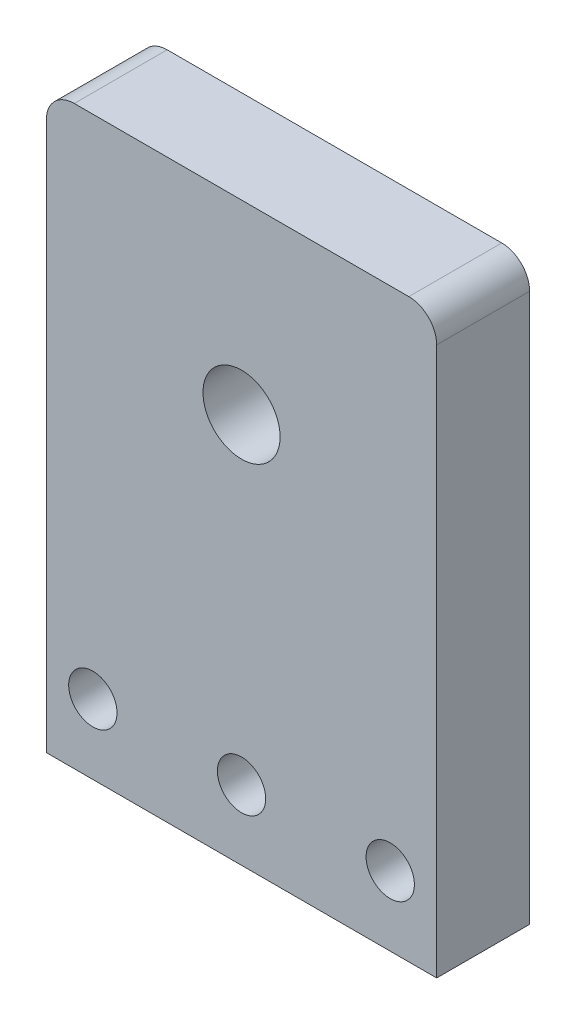
ISO-10303-21;
HEADER;
FILE_DESCRIPTION(('STEP AP214'),'2;1');
FILE_NAME('part.step','',(''),(''),'','','');
FILE_SCHEMA(('AUTOMOTIVE_DESIGN { 1 0 10303 214 1 1 1 1 }'));
ENDSEC;
DATA;
#1=APPLICATION_CONTEXT('core data for automotive mechanical design processes');
#2=APPLICATION_PROTOCOL_DEFINITION('international standard','automotive_design',2000,#1);
#3=PRODUCT_CONTEXT('',#1,'mechanical');
#4=PRODUCT('Part','Part','',(#3));
#5=PRODUCT_RELATED_PRODUCT_CATEGORY('part','',(#4));
#6=PRODUCT_DEFINITION_FORMATION('','',#4);
#7=PRODUCT_DEFINITION_CONTEXT('part definition',#1,'design');
#8=PRODUCT_DEFINITION('design','',#6,#7);
#9=PRODUCT_DEFINITION_SHAPE('','',#8);
#10=(LENGTH_UNIT() NAMED_UNIT(*) SI_UNIT(.MILLI.,.METRE.));
#11=(NAMED_UNIT(*) PLANE_ANGLE_UNIT() SI_UNIT($,.RADIAN.));
#12=(NAMED_UNIT(*) SI_UNIT($,.STERADIAN.) SOLID_ANGLE_UNIT());
#13=UNCERTAINTY_MEASURE_WITH_UNIT(LENGTH_MEASURE(1.E-05),#10,'distance_accuracy_value','');
#14=(GEOMETRIC_REPRESENTATION_CONTEXT(3) GLOBAL_UNCERTAINTY_ASSIGNED_CONTEXT((#13)) GLOBAL_UNIT_ASSIGNED_CONTEXT((#10,
#11,#12)) REPRESENTATION_CONTEXT('',''));
#15=CARTESIAN_POINT('',(0.,0.,0.));
#16=DIRECTION('',(0.,0.,1.));
#17=DIRECTION('',(1.,0.,0.));
#18=AXIS2_PLACEMENT_3D('',#15,#16,#17);
#19=CARTESIAN_POINT('',(0.,0.,10.));
#20=DIRECTION('',(0.,0.,-1.));
#21=DIRECTION('',(-1.,0.,0.));
#22=AXIS2_PLACEMENT_3D('',#19,#20,#21);
#23=PLANE('',#22);
#24=CARTESIAN_POINT('',(4.99999999999999,7.5,10.));
#25=DIRECTION('',(0.,0.,1.));
#26=DIRECTION('',(1.,0.,0.));
#27=AXIS2_PLACEMENT_3D('',#24,#25,#26);
#28=CIRCLE('',#27,2.6);
#29=CARTESIAN_POINT('',(7.59999999999999,7.5,10.));
#30=VERTEX_POINT('',#29);
#31=EDGE_CURVE('E199',#30,#30,#28,.T.);
#32=ORIENTED_EDGE('',*,*,#31,.F.);
#33=EDGE_LOOP('',(#32));
#34=FACE_BOUND('',#33,.T.);
#35=CARTESIAN_POINT('',(21.,7.5,10.));
#36=DIRECTION('',(0.,0.,1.));
#37=DIRECTION('',(1.,0.,0.));
#38=AXIS2_PLACEMENT_3D('',#35,#36,#37);
#39=CIRCLE('',#38,2.6);
#40=CARTESIAN_POINT('',(23.6,7.5,10.));
#41=VERTEX_POINT('',#40);
#42=EDGE_CURVE('E195',#41,#41,#39,.T.);
#43=ORIENTED_EDGE('',*,*,#42,.F.);
#44=EDGE_LOOP('',(#43));
#45=FACE_BOUND('',#44,.T.);
#46=CARTESIAN_POINT('',(37.,7.5,10.));
#47=DIRECTION('',(0.,0.,1.));
#48=DIRECTION('',(1.,0.,0.));
#49=AXIS2_PLACEMENT_3D('',#46,#47,#48);
#50=CIRCLE('',#49,2.6);
#51=CARTESIAN_POINT('',(39.6,7.5,10.));
#52=VERTEX_POINT('',#51);
#53=EDGE_CURVE('E187',#52,#52,#50,.T.);
#54=ORIENTED_EDGE('',*,*,#53,.F.);
#55=EDGE_LOOP('',(#54));
#56=FACE_BOUND('',#55,.T.);
#57=DIRECTION('',(0.,1.,0.));
#58=VECTOR('',#57,1.);
#59=CARTESIAN_POINT('',(42.,0.,10.));
#60=LINE('',#59,#58);
#61=CARTESIAN_POINT('',(42.,0.,10.));
#62=VERTEX_POINT('',#61);
#63=CARTESIAN_POINT('',(42.,59.,10.));
#64=VERTEX_POINT('',#63);
#65=EDGE_CURVE('E115',#62,#64,#60,.T.);
#66=ORIENTED_EDGE('',*,*,#65,.T.);
#67=CARTESIAN_POINT('',(39.,59.,10.));
#68=DIRECTION('',(0.,0.,-1.));
#69=DIRECTION('',(-1.,0.,0.));
#70=AXIS2_PLACEMENT_3D('',#67,#68,#69);
#71=CIRCLE('',#70,3.);
#72=CARTESIAN_POINT('',(39.,62.,10.));
#73=VERTEX_POINT('',#72);
#74=EDGE_CURVE('E52',#64,#73,#71,.F.);
#75=ORIENTED_EDGE('',*,*,#74,.T.);
#76=DIRECTION('',(-1.,0.,0.));
#77=VECTOR('',#76,1.);
#78=CARTESIAN_POINT('',(0.,62.,10.));
#79=LINE('',#78,#77);
#80=CARTESIAN_POINT('',(2.99999999999999,62.,10.));
#81=VERTEX_POINT('',#80);
#82=EDGE_CURVE('E128',#73,#81,#79,.T.);
#83=ORIENTED_EDGE('',*,*,#82,.T.);
#84=CARTESIAN_POINT('',(2.99999999999999,59.,10.));
#85=DIRECTION('',(0.,0.,-1.));
#86=DIRECTION('',(-1.,0.,0.));
#87=AXIS2_PLACEMENT_3D('',#84,#85,#86);
#88=CIRCLE('',#87,3.);
#89=CARTESIAN_POINT('',(0.,59.,10.));
#90=VERTEX_POINT('',#89);
#91=EDGE_CURVE('E59',#81,#90,#88,.F.);
#92=ORIENTED_EDGE('',*,*,#91,.T.);
#93=DIRECTION('',(0.,-1.,0.));
#94=VECTOR('',#93,1.);
#95=CARTESIAN_POINT('',(0.,0.,10.));
#96=LINE('',#95,#94);
#97=CARTESIAN_POINT('',(0.,0.,10.));
#98=VERTEX_POINT('',#97);
#99=EDGE_CURVE('E97',#90,#98,#96,.T.);
#100=ORIENTED_EDGE('',*,*,#99,.T.);
#101=DIRECTION('',(1.,0.,0.));
#102=VECTOR('',#101,1.);
#103=CARTESIAN_POINT('',(0.,0.,10.));
#104=LINE('',#103,#102);
#105=EDGE_CURVE('E100',#98,#62,#104,.T.);
#106=ORIENTED_EDGE('',*,*,#105,.T.);
#107=EDGE_LOOP('',(#66,#75,#83,#92,#100,#106));
#108=FACE_BOUND('',#107,.T.);
#109=CARTESIAN_POINT('',(21.,42.,10.));
#110=DIRECTION('',(0.,0.,1.));
#111=DIRECTION('',(1.,0.,0.));
#112=AXIS2_PLACEMENT_3D('',#109,#110,#111);
#113=CIRCLE('',#112,4.15);
#114=CARTESIAN_POINT('',(25.15,42.,10.));
#115=VERTEX_POINT('',#114);
#116=EDGE_CURVE('E171',#115,#115,#113,.T.);
#117=ORIENTED_EDGE('',*,*,#116,.F.);
#118=EDGE_LOOP('',(#117));
#119=FACE_BOUND('',#118,.T.);
#120=ADVANCED_FACE('F43',(#34,#45,#56,#108,#119),#23,.F.);
#121=CARTESIAN_POINT('',(0.,0.,0.));
#122=DIRECTION('',(0.,0.,-1.));
#123=DIRECTION('',(-1.,0.,0.));
#124=AXIS2_PLACEMENT_3D('',#121,#122,#123);
#125=PLANE('',#124);
#126=CARTESIAN_POINT('',(4.99999999999999,7.5,0.));
#127=DIRECTION('',(0.,0.,1.));
#128=DIRECTION('',(1.,0.,0.));
#129=AXIS2_PLACEMENT_3D('',#126,#127,#128);
#130=CIRCLE('',#129,2.6);
#131=CARTESIAN_POINT('',(7.59999999999999,7.5,0.));
#132=VERTEX_POINT('',#131);
#133=EDGE_CURVE('E179',#132,#132,#130,.T.);
#134=ORIENTED_EDGE('',*,*,#133,.T.);
#135=EDGE_LOOP('',(#134));
#136=FACE_BOUND('',#135,.T.);
#137=CARTESIAN_POINT('',(21.,7.5,0.));
#138=DIRECTION('',(0.,0.,1.));
#139=DIRECTION('',(1.,0.,0.));
#140=AXIS2_PLACEMENT_3D('',#137,#138,#139);
#141=CIRCLE('',#140,2.6);
#142=CARTESIAN_POINT('',(23.6,7.5,0.));
#143=VERTEX_POINT('',#142);
#144=EDGE_CURVE('E191',#143,#143,#141,.T.);
#145=ORIENTED_EDGE('',*,*,#144,.T.);
#146=EDGE_LOOP('',(#145));
#147=FACE_BOUND('',#146,.T.);
#148=CARTESIAN_POINT('',(37.,7.5,0.));
#149=DIRECTION('',(0.,0.,1.));
#150=DIRECTION('',(1.,0.,0.));
#151=AXIS2_PLACEMENT_3D('',#148,#149,#150);
#152=CIRCLE('',#151,2.6);
#153=CARTESIAN_POINT('',(39.6,7.5,0.));
#154=VERTEX_POINT('',#153);
#155=EDGE_CURVE('E183',#154,#154,#152,.T.);
#156=ORIENTED_EDGE('',*,*,#155,.T.);
#157=EDGE_LOOP('',(#156));
#158=FACE_BOUND('',#157,.T.);
#159=DIRECTION('',(-1.,0.,0.));
#160=VECTOR('',#159,1.);
#161=CARTESIAN_POINT('',(0.,62.,0.));
#162=LINE('',#161,#160);
#163=CARTESIAN_POINT('',(39.,62.,0.));
#164=VERTEX_POINT('',#163);
#165=CARTESIAN_POINT('',(2.99999999999999,62.,0.));
#166=VERTEX_POINT('',#165);
#167=EDGE_CURVE('E106',#164,#166,#162,.T.);
#168=ORIENTED_EDGE('',*,*,#167,.F.);
#169=CARTESIAN_POINT('',(39.,59.,0.));
#170=DIRECTION('',(0.,0.,-1.));
#171=DIRECTION('',(-1.,0.,0.));
#172=AXIS2_PLACEMENT_3D('',#169,#170,#171);
#173=CIRCLE('',#172,3.);
#174=CARTESIAN_POINT('',(42.,59.,0.));
#175=VERTEX_POINT('',#174);
#176=EDGE_CURVE('E138',#164,#175,#173,.T.);
#177=ORIENTED_EDGE('',*,*,#176,.T.);
#178=DIRECTION('',(0.,1.,0.));
#179=VECTOR('',#178,1.);
#180=CARTESIAN_POINT('',(42.,0.,0.));
#181=LINE('',#180,#179);
#182=CARTESIAN_POINT('',(42.,0.,0.));
#183=VERTEX_POINT('',#182);
#184=EDGE_CURVE('E161',#183,#175,#181,.T.);
#185=ORIENTED_EDGE('',*,*,#184,.F.);
#186=DIRECTION('',(1.,0.,0.));
#187=VECTOR('',#186,1.);
#188=CARTESIAN_POINT('',(0.,0.,0.));
#189=LINE('',#188,#187);
#190=CARTESIAN_POINT('',(0.,0.,0.));
#191=VERTEX_POINT('',#190);
#192=EDGE_CURVE('E164',#191,#183,#189,.T.);
#193=ORIENTED_EDGE('',*,*,#192,.F.);
#194=DIRECTION('',(0.,-1.,0.));
#195=VECTOR('',#194,1.);
#196=CARTESIAN_POINT('',(0.,0.,0.));
#197=LINE('',#196,#195);
#198=CARTESIAN_POINT('',(0.,59.,0.));
#199=VERTEX_POINT('',#198);
#200=EDGE_CURVE('E119',#199,#191,#197,.T.);
#201=ORIENTED_EDGE('',*,*,#200,.F.);
#202=CARTESIAN_POINT('',(2.99999999999999,59.,0.));
#203=DIRECTION('',(0.,0.,-1.));
#204=DIRECTION('',(-1.,0.,0.));
#205=AXIS2_PLACEMENT_3D('',#202,#203,#204);
#206=CIRCLE('',#205,3.);
#207=EDGE_CURVE('E135',#199,#166,#206,.T.);
#208=ORIENTED_EDGE('',*,*,#207,.T.);
#209=EDGE_LOOP('',(#168,#177,#185,#193,#201,#208));
#210=FACE_BOUND('',#209,.T.);
#211=CARTESIAN_POINT('',(21.,42.,0.));
#212=DIRECTION('',(0.,0.,1.));
#213=DIRECTION('',(1.,0.,0.));
#214=AXIS2_PLACEMENT_3D('',#211,#212,#213);
#215=CIRCLE('',#214,4.15);
#216=CARTESIAN_POINT('',(25.15,42.,0.));
#217=VERTEX_POINT('',#216);
#218=EDGE_CURVE('E175',#217,#217,#215,.T.);
#219=ORIENTED_EDGE('',*,*,#218,.T.);
#220=EDGE_LOOP('',(#219));
#221=FACE_BOUND('',#220,.T.);
#222=ADVANCED_FACE('F159',(#136,#147,#158,#210,#221),#125,.T.);
#223=CARTESIAN_POINT('',(0.,0.,10.));
#224=DIRECTION('',(1.,0.,0.));
#225=DIRECTION('',(0.,1.,0.));
#226=AXIS2_PLACEMENT_3D('',#223,#224,#225);
#227=PLANE('',#226);
#228=ORIENTED_EDGE('',*,*,#99,.F.);
#229=DIRECTION('',(0.,0.,-1.));
#230=VECTOR('',#229,1.);
#231=CARTESIAN_POINT('',(0.,59.,10.));
#232=LINE('',#231,#230);
#233=EDGE_CURVE('E11',#90,#199,#232,.T.);
#234=ORIENTED_EDGE('',*,*,#233,.T.);
#235=ORIENTED_EDGE('',*,*,#200,.T.);
#236=DIRECTION('',(0.,0.,-1.));
#237=VECTOR('',#236,1.);
#238=CARTESIAN_POINT('',(0.,0.,10.));
#239=LINE('',#238,#237);
#240=EDGE_CURVE('E111',#98,#191,#239,.T.);
#241=ORIENTED_EDGE('',*,*,#240,.F.);
#242=EDGE_LOOP('',(#228,#234,#235,#241));
#243=FACE_BOUND('',#242,.T.);
#244=ADVANCED_FACE('F117',(#243),#227,.F.);
#245=CARTESIAN_POINT('',(0.,0.,10.));
#246=DIRECTION('',(0.,1.,0.));
#247=DIRECTION('',(0.,0.,1.));
#248=AXIS2_PLACEMENT_3D('',#245,#246,#247);
#249=PLANE('',#248);
#250=ORIENTED_EDGE('',*,*,#192,.T.);
#251=DIRECTION('',(0.,0.,-1.));
#252=VECTOR('',#251,1.);
#253=CARTESIAN_POINT('',(42.,0.,10.));
#254=LINE('',#253,#252);
#255=EDGE_CURVE('E113',#62,#183,#254,.T.);
#256=ORIENTED_EDGE('',*,*,#255,.F.);
#257=ORIENTED_EDGE('',*,*,#105,.F.);
#258=ORIENTED_EDGE('',*,*,#240,.T.);
#259=EDGE_LOOP('',(#250,#256,#257,#258));
#260=FACE_BOUND('',#259,.T.);
#261=ADVANCED_FACE('F110',(#260),#249,.F.);
#262=CARTESIAN_POINT('',(42.,0.,10.));
#263=DIRECTION('',(-1.,0.,0.));
#264=DIRECTION('',(0.,-1.,0.));
#265=AXIS2_PLACEMENT_3D('',#262,#263,#264);
#266=PLANE('',#265);
#267=ORIENTED_EDGE('',*,*,#184,.T.);
#268=DIRECTION('',(0.,0.,-1.));
#269=VECTOR('',#268,1.);
#270=CARTESIAN_POINT('',(42.,59.,10.));
#271=LINE('',#270,#269);
#272=EDGE_CURVE('E67',#175,#64,#271,.F.);
#273=ORIENTED_EDGE('',*,*,#272,.T.);
#274=ORIENTED_EDGE('',*,*,#65,.F.);
#275=ORIENTED_EDGE('',*,*,#255,.T.);
#276=EDGE_LOOP('',(#267,#273,#274,#275));
#277=FACE_BOUND('',#276,.T.);
#278=ADVANCED_FACE('F162',(#277),#266,.F.);
#279=CARTESIAN_POINT('',(0.,62.,10.));
#280=DIRECTION('',(0.,-1.,0.));
#281=DIRECTION('',(0.,0.,-1.));
#282=AXIS2_PLACEMENT_3D('',#279,#280,#281);
#283=PLANE('',#282);
#284=ORIENTED_EDGE('',*,*,#82,.F.);
#285=DIRECTION('',(0.,0.,-1.));
#286=VECTOR('',#285,1.);
#287=CARTESIAN_POINT('',(39.,62.,10.));
#288=LINE('',#287,#286);
#289=EDGE_CURVE('E126',#73,#164,#288,.T.);
#290=ORIENTED_EDGE('',*,*,#289,.T.);
#291=ORIENTED_EDGE('',*,*,#167,.T.);
#292=DIRECTION('',(0.,0.,-1.));
#293=VECTOR('',#292,1.);
#294=CARTESIAN_POINT('',(2.99999999999999,62.,10.));
#295=LINE('',#294,#293);
#296=EDGE_CURVE('E122',#166,#81,#295,.F.);
#297=ORIENTED_EDGE('',*,*,#296,.T.);
#298=EDGE_LOOP('',(#284,#290,#291,#297));
#299=FACE_BOUND('',#298,.T.);
#300=ADVANCED_FACE('F150',(#299),#283,.F.);
#301=CARTESIAN_POINT('',(21.,42.,10.));
#302=DIRECTION('',(0.,0.,-1.));
#303=DIRECTION('',(-1.,0.,0.));
#304=AXIS2_PLACEMENT_3D('',#301,#302,#303);
#305=CYLINDRICAL_SURFACE('',#304,4.15);
#306=ORIENTED_EDGE('',*,*,#116,.T.);
#307=EDGE_LOOP('',(#306));
#308=FACE_BOUND('',#307,.T.);
#309=ORIENTED_EDGE('',*,*,#218,.F.);
#310=EDGE_LOOP('',(#309));
#311=FACE_BOUND('',#310,.T.);
#312=ADVANCED_FACE('F236',(#308,#311),#305,.F.);
#313=CARTESIAN_POINT('',(39.,59.,10.));
#314=DIRECTION('',(0.,0.,-1.));
#315=DIRECTION('',(-1.,0.,0.));
#316=AXIS2_PLACEMENT_3D('',#313,#314,#315);
#317=CYLINDRICAL_SURFACE('',#316,3.);
#318=ORIENTED_EDGE('',*,*,#74,.F.);
#319=ORIENTED_EDGE('',*,*,#272,.F.);
#320=ORIENTED_EDGE('',*,*,#176,.F.);
#321=ORIENTED_EDGE('',*,*,#289,.F.);
#322=EDGE_LOOP('',(#318,#319,#320,#321));
#323=FACE_BOUND('',#322,.T.);
#324=ADVANCED_FACE('F156',(#323),#317,.T.);
#325=CARTESIAN_POINT('',(2.99999999999999,59.,10.));
#326=DIRECTION('',(0.,0.,-1.));
#327=DIRECTION('',(-1.,0.,0.));
#328=AXIS2_PLACEMENT_3D('',#325,#326,#327);
#329=CYLINDRICAL_SURFACE('',#328,3.);
#330=ORIENTED_EDGE('',*,*,#91,.F.);
#331=ORIENTED_EDGE('',*,*,#296,.F.);
#332=ORIENTED_EDGE('',*,*,#207,.F.);
#333=ORIENTED_EDGE('',*,*,#233,.F.);
#334=EDGE_LOOP('',(#330,#331,#332,#333));
#335=FACE_BOUND('',#334,.T.);
#336=ADVANCED_FACE('F45',(#335),#329,.T.);
#337=CARTESIAN_POINT('',(37.,7.5,0.));
#338=DIRECTION('',(0.,0.,1.));
#339=DIRECTION('',(1.,0.,0.));
#340=AXIS2_PLACEMENT_3D('',#337,#338,#339);
#341=CYLINDRICAL_SURFACE('',#340,2.6);
#342=ORIENTED_EDGE('',*,*,#155,.F.);
#343=EDGE_LOOP('',(#342));
#344=FACE_BOUND('',#343,.T.);
#345=ORIENTED_EDGE('',*,*,#53,.T.);
#346=EDGE_LOOP('',(#345));
#347=FACE_BOUND('',#346,.T.);
#348=ADVANCED_FACE('F223',(#344,#347),#341,.F.);
#349=CARTESIAN_POINT('',(21.,7.5,0.));
#350=DIRECTION('',(0.,0.,1.));
#351=DIRECTION('',(1.,0.,0.));
#352=AXIS2_PLACEMENT_3D('',#349,#350,#351);
#353=CYLINDRICAL_SURFACE('',#352,2.6);
#354=ORIENTED_EDGE('',*,*,#144,.F.);
#355=EDGE_LOOP('',(#354));
#356=FACE_BOUND('',#355,.T.);
#357=ORIENTED_EDGE('',*,*,#42,.T.);
#358=EDGE_LOOP('',(#357));
#359=FACE_BOUND('',#358,.T.);
#360=ADVANCED_FACE('F212',(#356,#359),#353,.F.);
#361=CARTESIAN_POINT('',(4.99999999999999,7.5,0.));
#362=DIRECTION('',(0.,0.,1.));
#363=DIRECTION('',(1.,0.,0.));
#364=AXIS2_PLACEMENT_3D('',#361,#362,#363);
#365=CYLINDRICAL_SURFACE('',#364,2.6);
#366=ORIENTED_EDGE('',*,*,#133,.F.);
#367=EDGE_LOOP('',(#366));
#368=FACE_BOUND('',#367,.T.);
#369=ORIENTED_EDGE('',*,*,#31,.T.);
#370=EDGE_LOOP('',(#369));
#371=FACE_BOUND('',#370,.T.);
#372=ADVANCED_FACE('F209',(#368,#371),#365,.F.);
#373=CLOSED_SHELL('',(#120,#222,#244,#261,#278,#300,#312,#324,#336,#348,#360,#372));
#374=MANIFOLD_SOLID_BREP('B2',#373);
#375=ADVANCED_BREP_SHAPE_REPRESENTATION('',(#18,#374),#14);
#376=SHAPE_DEFINITION_REPRESENTATION(#9,#375);
ENDSEC;
END-ISO-10303-21;
